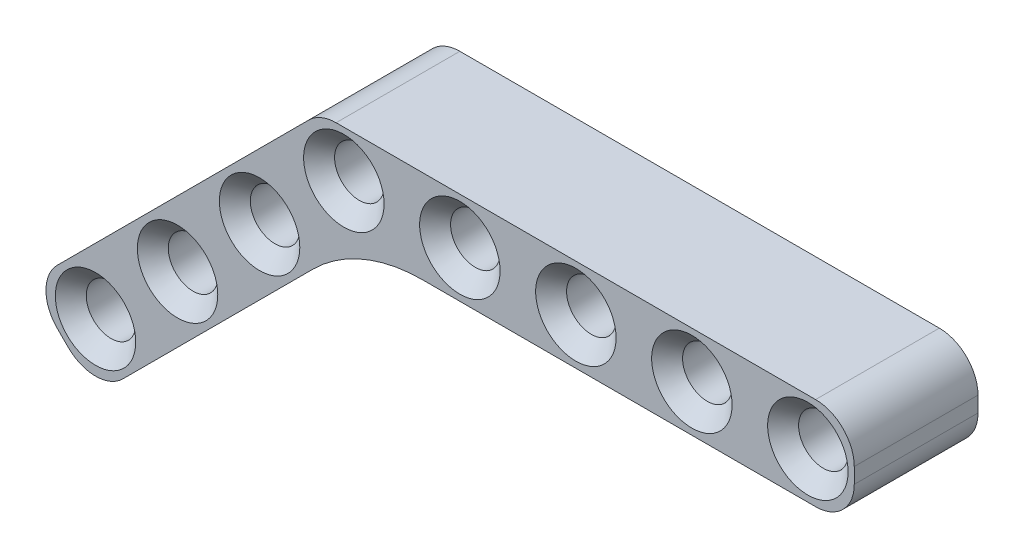
ISO-10303-21;
HEADER;
FILE_DESCRIPTION(('STEP AP214'),'2;1');
FILE_NAME('part.step','',(''),(''),'','','');
FILE_SCHEMA(('AUTOMOTIVE_DESIGN { 1 0 10303 214 1 1 1 1 }'));
ENDSEC;
DATA;
#1=APPLICATION_CONTEXT('core data for automotive mechanical design processes');
#2=APPLICATION_PROTOCOL_DEFINITION('international standard','automotive_design',2000,#1);
#3=PRODUCT_CONTEXT('',#1,'mechanical');
#4=PRODUCT('Part','Part','',(#3));
#5=PRODUCT_RELATED_PRODUCT_CATEGORY('part','',(#4));
#6=PRODUCT_DEFINITION_FORMATION('','',#4);
#7=PRODUCT_DEFINITION_CONTEXT('part definition',#1,'design');
#8=PRODUCT_DEFINITION('design','',#6,#7);
#9=PRODUCT_DEFINITION_SHAPE('','',#8);
#10=(LENGTH_UNIT() NAMED_UNIT(*) SI_UNIT(.MILLI.,.METRE.));
#11=(NAMED_UNIT(*) PLANE_ANGLE_UNIT() SI_UNIT($,.RADIAN.));
#12=(NAMED_UNIT(*) SI_UNIT($,.STERADIAN.) SOLID_ANGLE_UNIT());
#13=UNCERTAINTY_MEASURE_WITH_UNIT(LENGTH_MEASURE(1.E-05),#10,'distance_accuracy_value','');
#14=(GEOMETRIC_REPRESENTATION_CONTEXT(3) GLOBAL_UNCERTAINTY_ASSIGNED_CONTEXT((#13)) GLOBAL_UNIT_ASSIGNED_CONTEXT((#10,
#11,#12)) REPRESENTATION_CONTEXT('',''));
#15=CARTESIAN_POINT('',(0.,0.,0.));
#16=DIRECTION('',(0.,0.,1.));
#17=DIRECTION('',(1.,0.,0.));
#18=AXIS2_PLACEMENT_3D('',#15,#16,#17);
#19=CARTESIAN_POINT('',(-0.5,0.5,8.));
#20=DIRECTION('',(0.,0.,-1.));
#21=DIRECTION('',(-1.,0.,0.));
#22=AXIS2_PLACEMENT_3D('',#19,#20,#21);
#23=CYLINDRICAL_SURFACE('',#22,2.5);
#24=DIRECTION('',(0.,0.,1.));
#25=VECTOR('',#24,1.);
#26=CARTESIAN_POINT('',(-2.26776695296637,2.26776695296637,0.));
#27=LINE('',#26,#25);
#28=CARTESIAN_POINT('',(-2.26776695296637,2.26776695296637,0.));
#29=VERTEX_POINT('',#28);
#30=CARTESIAN_POINT('',(-2.26776695296637,2.26776695296637,8.));
#31=VERTEX_POINT('',#30);
#32=EDGE_CURVE('E172',#29,#31,#27,.T.);
#33=ORIENTED_EDGE('',*,*,#32,.T.);
#34=CARTESIAN_POINT('',(-0.5,0.5,8.));
#35=DIRECTION('',(0.,0.,1.));
#36=DIRECTION('',(1.,0.,0.));
#37=AXIS2_PLACEMENT_3D('',#34,#35,#36);
#38=CIRCLE('',#37,2.5);
#39=CARTESIAN_POINT('',(-0.5,3.,8.));
#40=VERTEX_POINT('',#39);
#41=EDGE_CURVE('E186',#40,#31,#38,.T.);
#42=ORIENTED_EDGE('',*,*,#41,.F.);
#43=DIRECTION('',(0.,0.,-1.));
#44=VECTOR('',#43,1.);
#45=CARTESIAN_POINT('',(-0.5,3.,8.));
#46=LINE('',#45,#44);
#47=CARTESIAN_POINT('',(-0.5,3.,0.));
#48=VERTEX_POINT('',#47);
#49=EDGE_CURVE('E206',#40,#48,#46,.T.);
#50=ORIENTED_EDGE('',*,*,#49,.T.);
#51=CARTESIAN_POINT('',(-0.5,0.5,0.));
#52=DIRECTION('',(0.,0.,1.));
#53=DIRECTION('',(1.,0.,0.));
#54=AXIS2_PLACEMENT_3D('',#51,#52,#53);
#55=CIRCLE('',#54,2.5);
#56=EDGE_CURVE('E200',#48,#29,#55,.T.);
#57=ORIENTED_EDGE('',*,*,#56,.T.);
#58=EDGE_LOOP('',(#33,#42,#50,#57));
#59=FACE_BOUND('',#58,.T.);
#60=ADVANCED_FACE('F35',(#59),#23,.T.);
#61=CARTESIAN_POINT('',(30.5,-0.5,8.));
#62=DIRECTION('',(0.,0.,1.));
#63=DIRECTION('',(1.,0.,0.));
#64=AXIS2_PLACEMENT_3D('',#61,#62,#63);
#65=PLANE('',#64);
#66=CARTESIAN_POINT('',(-16.0543267947628,-15.7614335759495,8.));
#67=DIRECTION('',(0.,0.,1.));
#68=DIRECTION('',(1.,0.,0.));
#69=AXIS2_PLACEMENT_3D('',#66,#67,#68);
#70=CIRCLE('',#69,2.59999999999999);
#71=CARTESIAN_POINT('',(-13.4543267947628,-15.7614335759495,8.));
#72=VERTEX_POINT('',#71);
#73=EDGE_CURVE('E297',#72,#72,#70,.F.);
#74=ORIENTED_EDGE('',*,*,#73,.T.);
#75=EDGE_LOOP('',(#74));
#76=FACE_BOUND('',#75,.T.);
#77=CARTESIAN_POINT('',(-10.7510259358637,-10.4581327170504,8.));
#78=DIRECTION('',(0.,0.,1.));
#79=DIRECTION('',(1.,0.,0.));
#80=AXIS2_PLACEMENT_3D('',#77,#78,#79);
#81=CIRCLE('',#80,2.59999999999999);
#82=CARTESIAN_POINT('',(-8.15102593586371,-10.4581327170504,8.));
#83=VERTEX_POINT('',#82);
#84=EDGE_CURVE('E294',#83,#83,#81,.F.);
#85=ORIENTED_EDGE('',*,*,#84,.T.);
#86=EDGE_LOOP('',(#85));
#87=FACE_BOUND('',#86,.T.);
#88=CARTESIAN_POINT('',(-5.44772507696464,-5.15483185815121,8.));
#89=DIRECTION('',(0.,0.,1.));
#90=DIRECTION('',(1.,0.,0.));
#91=AXIS2_PLACEMENT_3D('',#88,#89,#90);
#92=CIRCLE('',#91,2.6);
#93=CARTESIAN_POINT('',(-2.84772507696463,-5.15483185815121,8.));
#94=VERTEX_POINT('',#93);
#95=EDGE_CURVE('E291',#94,#94,#92,.F.);
#96=ORIENTED_EDGE('',*,*,#95,.T.);
#97=EDGE_LOOP('',(#96));
#98=FACE_BOUND('',#97,.T.);
#99=CARTESIAN_POINT('',(30.,0.,8.));
#100=DIRECTION('',(0.,0.,1.));
#101=DIRECTION('',(1.,0.,0.));
#102=AXIS2_PLACEMENT_3D('',#99,#100,#101);
#103=CIRCLE('',#102,2.6);
#104=CARTESIAN_POINT('',(32.6,0.,8.));
#105=VERTEX_POINT('',#104);
#106=EDGE_CURVE('E251',#105,#105,#103,.F.);
#107=ORIENTED_EDGE('',*,*,#106,.T.);
#108=EDGE_LOOP('',(#107));
#109=FACE_BOUND('',#108,.T.);
#110=CARTESIAN_POINT('',(22.5,0.,8.));
#111=DIRECTION('',(0.,0.,1.));
#112=DIRECTION('',(1.,0.,0.));
#113=AXIS2_PLACEMENT_3D('',#110,#111,#112);
#114=CIRCLE('',#113,2.6);
#115=CARTESIAN_POINT('',(25.1,0.,8.));
#116=VERTEX_POINT('',#115);
#117=EDGE_CURVE('E248',#116,#116,#114,.F.);
#118=ORIENTED_EDGE('',*,*,#117,.T.);
#119=EDGE_LOOP('',(#118));
#120=FACE_BOUND('',#119,.T.);
#121=CARTESIAN_POINT('',(15.,0.,8.));
#122=DIRECTION('',(0.,0.,1.));
#123=DIRECTION('',(1.,0.,0.));
#124=AXIS2_PLACEMENT_3D('',#121,#122,#123);
#125=CIRCLE('',#124,2.6);
#126=CARTESIAN_POINT('',(17.6,0.,8.));
#127=VERTEX_POINT('',#126);
#128=EDGE_CURVE('E245',#127,#127,#125,.F.);
#129=ORIENTED_EDGE('',*,*,#128,.T.);
#130=EDGE_LOOP('',(#129));
#131=FACE_BOUND('',#130,.T.);
#132=CARTESIAN_POINT('',(7.5,0.,8.));
#133=DIRECTION('',(0.,0.,1.));
#134=DIRECTION('',(1.,0.,0.));
#135=AXIS2_PLACEMENT_3D('',#132,#133,#134);
#136=CIRCLE('',#135,2.6);
#137=CARTESIAN_POINT('',(10.1,0.,8.));
#138=VERTEX_POINT('',#137);
#139=EDGE_CURVE('E242',#138,#138,#136,.F.);
#140=ORIENTED_EDGE('',*,*,#139,.T.);
#141=EDGE_LOOP('',(#140));
#142=FACE_BOUND('',#141,.T.);
#143=CARTESIAN_POINT('',(0.,0.,8.));
#144=DIRECTION('',(0.,0.,1.));
#145=DIRECTION('',(1.,0.,0.));
#146=AXIS2_PLACEMENT_3D('',#143,#144,#145);
#147=CIRCLE('',#146,2.6);
#148=CARTESIAN_POINT('',(2.6,0.,8.));
#149=VERTEX_POINT('',#148);
#150=EDGE_CURVE('E239',#149,#149,#147,.F.);
#151=ORIENTED_EDGE('',*,*,#150,.T.);
#152=EDGE_LOOP('',(#151));
#153=FACE_BOUND('',#152,.T.);
#154=CARTESIAN_POINT('',(30.5,-0.5,8.));
#155=DIRECTION('',(0.,0.,1.));
#156=DIRECTION('',(1.,0.,0.));
#157=AXIS2_PLACEMENT_3D('',#154,#155,#156);
#158=CIRCLE('',#157,2.5);
#159=CARTESIAN_POINT('',(30.5,-3.,8.));
#160=VERTEX_POINT('',#159);
#161=CARTESIAN_POINT('',(33.,-0.5,8.));
#162=VERTEX_POINT('',#161);
#163=EDGE_CURVE('E176',#160,#162,#158,.T.);
#164=ORIENTED_EDGE('',*,*,#163,.T.);
#165=DIRECTION('',(0.,1.,0.));
#166=VECTOR('',#165,1.);
#167=CARTESIAN_POINT('',(33.,0.5,8.));
#168=LINE('',#167,#166);
#169=CARTESIAN_POINT('',(33.,0.5,8.));
#170=VERTEX_POINT('',#169);
#171=EDGE_CURVE('E179',#162,#170,#168,.T.);
#172=ORIENTED_EDGE('',*,*,#171,.T.);
#173=CARTESIAN_POINT('',(30.5,0.5,8.));
#174=DIRECTION('',(0.,0.,1.));
#175=DIRECTION('',(-1.,0.,0.));
#176=AXIS2_PLACEMENT_3D('',#173,#174,#175);
#177=CIRCLE('',#176,2.5);
#178=CARTESIAN_POINT('',(30.5,3.,8.));
#179=VERTEX_POINT('',#178);
#180=EDGE_CURVE('E182',#170,#179,#177,.T.);
#181=ORIENTED_EDGE('',*,*,#180,.T.);
#182=DIRECTION('',(-1.,0.,0.));
#183=VECTOR('',#182,1.);
#184=CARTESIAN_POINT('',(-0.5,3.,8.));
#185=LINE('',#184,#183);
#186=EDGE_CURVE('E184',#179,#40,#185,.T.);
#187=ORIENTED_EDGE('',*,*,#186,.T.);
#188=ORIENTED_EDGE('',*,*,#41,.T.);
#189=DIRECTION('',(-0.707106781186546,-0.707106781186549,0.));
#190=VECTOR('',#189,1.);
#191=CARTESIAN_POINT('',(-2.26776695296637,2.26776695296636,8.));
#192=LINE('',#191,#190);
#193=CARTESIAN_POINT('',(-18.5292005289157,-13.9936666229831,8.));
#194=VERTEX_POINT('',#193);
#195=EDGE_CURVE('E153',#31,#194,#192,.T.);
#196=ORIENTED_EDGE('',*,*,#195,.T.);
#197=CARTESIAN_POINT('',(-16.7614335759494,-15.7614335759494,8.));
#198=DIRECTION('',(0.,0.,1.));
#199=DIRECTION('',(1.,0.,0.));
#200=AXIS2_PLACEMENT_3D('',#197,#198,#199);
#201=CIRCLE('',#200,2.5);
#202=CARTESIAN_POINT('',(-18.5292005289157,-17.5292005289158,8.));
#203=VERTEX_POINT('',#202);
#204=EDGE_CURVE('E150',#194,#203,#201,.T.);
#205=ORIENTED_EDGE('',*,*,#204,.T.);
#206=DIRECTION('',(0.707106781186546,-0.707106781186549,0.));
#207=VECTOR('',#206,1.);
#208=CARTESIAN_POINT('',(-18.0292005289158,-18.0292005289157,8.));
#209=LINE('',#208,#207);
#210=CARTESIAN_POINT('',(-17.8220937477292,-18.2363073101024,8.));
#211=VERTEX_POINT('',#210);
#212=EDGE_CURVE('E161',#203,#211,#209,.T.);
#213=ORIENTED_EDGE('',*,*,#212,.T.);
#214=CARTESIAN_POINT('',(-16.0543267947628,-16.468540357136,8.));
#215=DIRECTION('',(0.,0.,1.));
#216=DIRECTION('',(1.,0.,0.));
#217=AXIS2_PLACEMENT_3D('',#214,#215,#216);
#218=CIRCLE('',#217,2.5);
#219=CARTESIAN_POINT('',(-14.2865598417965,-18.2363073101024,8.));
#220=VERTEX_POINT('',#219);
#221=EDGE_CURVE('E129',#211,#220,#218,.T.);
#222=ORIENTED_EDGE('',*,*,#221,.T.);
#223=DIRECTION('',(0.707106781186546,0.707106781186549,0.));
#224=VECTOR('',#223,1.);
#225=CARTESIAN_POINT('',(1.97487373415292,-1.97487373415292,8.));
#226=LINE('',#225,#224);
#227=CARTESIAN_POINT('',(-1.97918471982868,-5.92893218813454,8.));
#228=VERTEX_POINT('',#227);
#229=EDGE_CURVE('E164',#220,#228,#226,.T.);
#230=ORIENTED_EDGE('',*,*,#229,.T.);
#231=CARTESIAN_POINT('',(5.09188309203681,-13.,8.));
#232=DIRECTION('',(0.,0.,1.));
#233=DIRECTION('',(1.,0.,0.));
#234=AXIS2_PLACEMENT_3D('',#231,#232,#233);
#235=CIRCLE('',#234,10.);
#236=CARTESIAN_POINT('',(5.09188309203681,-3.,8.));
#237=VERTEX_POINT('',#236);
#238=EDGE_CURVE('E58',#228,#237,#235,.F.);
#239=ORIENTED_EDGE('',*,*,#238,.T.);
#240=DIRECTION('',(1.,0.,0.));
#241=VECTOR('',#240,1.);
#242=CARTESIAN_POINT('',(-0.5,-3.,8.));
#243=LINE('',#242,#241);
#244=EDGE_CURVE('E189',#237,#160,#243,.T.);
#245=ORIENTED_EDGE('',*,*,#244,.T.);
#246=EDGE_LOOP('',(#164,#172,#181,#187,#188,#196,#205,#213,#222,#230,#239,#245));
#247=FACE_BOUND('',#246,.T.);
#248=ADVANCED_FACE('F327',(#76,#87,#98,#109,#120,#131,#142,#153,#247),#65,.T.);
#249=CARTESIAN_POINT('',(30.5,-0.5,0.));
#250=DIRECTION('',(0.,0.,1.));
#251=DIRECTION('',(1.,0.,0.));
#252=AXIS2_PLACEMENT_3D('',#249,#250,#251);
#253=PLANE('',#252);
#254=CARTESIAN_POINT('',(-16.0543267947628,-15.7614335759495,0.));
#255=DIRECTION('',(0.,0.,1.));
#256=DIRECTION('',(1.,0.,0.));
#257=AXIS2_PLACEMENT_3D('',#254,#255,#256);
#258=CIRCLE('',#257,2.6);
#259=CARTESIAN_POINT('',(-13.4543267947628,-15.7614335759495,0.));
#260=VERTEX_POINT('',#259);
#261=EDGE_CURVE('E306',#260,#260,#258,.T.);
#262=ORIENTED_EDGE('',*,*,#261,.T.);
#263=EDGE_LOOP('',(#262));
#264=FACE_BOUND('',#263,.T.);
#265=CARTESIAN_POINT('',(-10.7510259358637,-10.4581327170504,0.));
#266=DIRECTION('',(0.,0.,1.));
#267=DIRECTION('',(1.,0.,0.));
#268=AXIS2_PLACEMENT_3D('',#265,#266,#267);
#269=CIRCLE('',#268,2.6);
#270=CARTESIAN_POINT('',(-8.1510259358637,-10.4581327170504,0.));
#271=VERTEX_POINT('',#270);
#272=EDGE_CURVE('E303',#271,#271,#269,.T.);
#273=ORIENTED_EDGE('',*,*,#272,.T.);
#274=EDGE_LOOP('',(#273));
#275=FACE_BOUND('',#274,.T.);
#276=CARTESIAN_POINT('',(-5.44772507696464,-5.15483185815121,0.));
#277=DIRECTION('',(0.,0.,1.));
#278=DIRECTION('',(1.,0.,0.));
#279=AXIS2_PLACEMENT_3D('',#276,#277,#278);
#280=CIRCLE('',#279,2.6);
#281=CARTESIAN_POINT('',(-2.84772507696463,-5.15483185815121,0.));
#282=VERTEX_POINT('',#281);
#283=EDGE_CURVE('E300',#282,#282,#280,.T.);
#284=ORIENTED_EDGE('',*,*,#283,.T.);
#285=EDGE_LOOP('',(#284));
#286=FACE_BOUND('',#285,.T.);
#287=CARTESIAN_POINT('',(30.,0.,0.));
#288=DIRECTION('',(0.,0.,1.));
#289=DIRECTION('',(1.,0.,0.));
#290=AXIS2_PLACEMENT_3D('',#287,#288,#289);
#291=CIRCLE('',#290,2.6);
#292=CARTESIAN_POINT('',(32.6,0.,0.));
#293=VERTEX_POINT('',#292);
#294=EDGE_CURVE('E230',#293,#293,#291,.T.);
#295=ORIENTED_EDGE('',*,*,#294,.T.);
#296=EDGE_LOOP('',(#295));
#297=FACE_BOUND('',#296,.T.);
#298=CARTESIAN_POINT('',(22.5,0.,0.));
#299=DIRECTION('',(0.,0.,1.));
#300=DIRECTION('',(1.,0.,0.));
#301=AXIS2_PLACEMENT_3D('',#298,#299,#300);
#302=CIRCLE('',#301,2.59999999999999);
#303=CARTESIAN_POINT('',(25.1,0.,0.));
#304=VERTEX_POINT('',#303);
#305=EDGE_CURVE('E227',#304,#304,#302,.T.);
#306=ORIENTED_EDGE('',*,*,#305,.T.);
#307=EDGE_LOOP('',(#306));
#308=FACE_BOUND('',#307,.T.);
#309=CARTESIAN_POINT('',(15.,0.,0.));
#310=DIRECTION('',(0.,0.,1.));
#311=DIRECTION('',(1.,0.,0.));
#312=AXIS2_PLACEMENT_3D('',#309,#310,#311);
#313=CIRCLE('',#312,2.59999999999999);
#314=CARTESIAN_POINT('',(17.6,0.,0.));
#315=VERTEX_POINT('',#314);
#316=EDGE_CURVE('E224',#315,#315,#313,.T.);
#317=ORIENTED_EDGE('',*,*,#316,.T.);
#318=EDGE_LOOP('',(#317));
#319=FACE_BOUND('',#318,.T.);
#320=CARTESIAN_POINT('',(7.5,0.,0.));
#321=DIRECTION('',(0.,0.,1.));
#322=DIRECTION('',(1.,0.,0.));
#323=AXIS2_PLACEMENT_3D('',#320,#321,#322);
#324=CIRCLE('',#323,2.6);
#325=CARTESIAN_POINT('',(10.1,0.,0.));
#326=VERTEX_POINT('',#325);
#327=EDGE_CURVE('E221',#326,#326,#324,.T.);
#328=ORIENTED_EDGE('',*,*,#327,.T.);
#329=EDGE_LOOP('',(#328));
#330=FACE_BOUND('',#329,.T.);
#331=CARTESIAN_POINT('',(0.,0.,0.));
#332=DIRECTION('',(0.,0.,1.));
#333=DIRECTION('',(1.,0.,0.));
#334=AXIS2_PLACEMENT_3D('',#331,#332,#333);
#335=CIRCLE('',#334,2.6);
#336=CARTESIAN_POINT('',(2.6,0.,0.));
#337=VERTEX_POINT('',#336);
#338=EDGE_CURVE('E218',#337,#337,#335,.T.);
#339=ORIENTED_EDGE('',*,*,#338,.T.);
#340=EDGE_LOOP('',(#339));
#341=FACE_BOUND('',#340,.T.);
#342=CARTESIAN_POINT('',(30.5,-0.5,0.));
#343=DIRECTION('',(0.,0.,1.));
#344=DIRECTION('',(1.,0.,0.));
#345=AXIS2_PLACEMENT_3D('',#342,#343,#344);
#346=CIRCLE('',#345,2.5);
#347=CARTESIAN_POINT('',(30.5,-3.,0.));
#348=VERTEX_POINT('',#347);
#349=CARTESIAN_POINT('',(33.,-0.5,0.));
#350=VERTEX_POINT('',#349);
#351=EDGE_CURVE('E169',#348,#350,#346,.T.);
#352=ORIENTED_EDGE('',*,*,#351,.F.);
#353=DIRECTION('',(1.,0.,0.));
#354=VECTOR('',#353,1.);
#355=CARTESIAN_POINT('',(-0.5,-3.,0.));
#356=LINE('',#355,#354);
#357=CARTESIAN_POINT('',(5.09188309203681,-3.,0.));
#358=VERTEX_POINT('',#357);
#359=EDGE_CURVE('E180',#358,#348,#356,.T.);
#360=ORIENTED_EDGE('',*,*,#359,.F.);
#361=CARTESIAN_POINT('',(5.09188309203681,-13.,0.));
#362=DIRECTION('',(0.,0.,1.));
#363=DIRECTION('',(1.,0.,0.));
#364=AXIS2_PLACEMENT_3D('',#361,#362,#363);
#365=CIRCLE('',#364,10.);
#366=CARTESIAN_POINT('',(-1.97918471982868,-5.92893218813454,0.));
#367=VERTEX_POINT('',#366);
#368=EDGE_CURVE('E283',#358,#367,#365,.T.);
#369=ORIENTED_EDGE('',*,*,#368,.T.);
#370=DIRECTION('',(0.707106781186546,0.707106781186549,0.));
#371=VECTOR('',#370,1.);
#372=CARTESIAN_POINT('',(1.97487373415292,-1.97487373415292,0.));
#373=LINE('',#372,#371);
#374=CARTESIAN_POINT('',(-14.2865598417965,-18.2363073101024,0.));
#375=VERTEX_POINT('',#374);
#376=EDGE_CURVE('E146',#375,#367,#373,.T.);
#377=ORIENTED_EDGE('',*,*,#376,.F.);
#378=CARTESIAN_POINT('',(-16.0543267947628,-16.468540357136,0.));
#379=DIRECTION('',(0.,0.,1.));
#380=DIRECTION('',(1.,0.,0.));
#381=AXIS2_PLACEMENT_3D('',#378,#379,#380);
#382=CIRCLE('',#381,2.5);
#383=CARTESIAN_POINT('',(-17.8220937477292,-18.2363073101024,0.));
#384=VERTEX_POINT('',#383);
#385=EDGE_CURVE('E127',#384,#375,#382,.T.);
#386=ORIENTED_EDGE('',*,*,#385,.F.);
#387=DIRECTION('',(0.707106781186546,-0.707106781186549,0.));
#388=VECTOR('',#387,1.);
#389=CARTESIAN_POINT('',(-18.0292005289158,-18.0292005289157,0.));
#390=LINE('',#389,#388);
#391=CARTESIAN_POINT('',(-18.5292005289157,-17.5292005289158,0.));
#392=VERTEX_POINT('',#391);
#393=EDGE_CURVE('E143',#392,#384,#390,.T.);
#394=ORIENTED_EDGE('',*,*,#393,.F.);
#395=CARTESIAN_POINT('',(-16.7614335759494,-15.7614335759494,0.));
#396=DIRECTION('',(0.,0.,1.));
#397=DIRECTION('',(1.,0.,0.));
#398=AXIS2_PLACEMENT_3D('',#395,#396,#397);
#399=CIRCLE('',#398,2.5);
#400=CARTESIAN_POINT('',(-18.5292005289157,-13.9936666229831,0.));
#401=VERTEX_POINT('',#400);
#402=EDGE_CURVE('E135',#401,#392,#399,.T.);
#403=ORIENTED_EDGE('',*,*,#402,.F.);
#404=DIRECTION('',(-0.707106781186546,-0.707106781186549,0.));
#405=VECTOR('',#404,1.);
#406=CARTESIAN_POINT('',(-2.26776695296637,2.26776695296636,0.));
#407=LINE('',#406,#405);
#408=EDGE_CURVE('E157',#29,#401,#407,.T.);
#409=ORIENTED_EDGE('',*,*,#408,.F.);
#410=ORIENTED_EDGE('',*,*,#56,.F.);
#411=DIRECTION('',(-1.,0.,0.));
#412=VECTOR('',#411,1.);
#413=CARTESIAN_POINT('',(-0.5,3.,0.));
#414=LINE('',#413,#412);
#415=CARTESIAN_POINT('',(30.5,3.,0.));
#416=VERTEX_POINT('',#415);
#417=EDGE_CURVE('E198',#416,#48,#414,.T.);
#418=ORIENTED_EDGE('',*,*,#417,.F.);
#419=CARTESIAN_POINT('',(30.5,0.5,0.));
#420=DIRECTION('',(0.,0.,1.));
#421=DIRECTION('',(-1.,0.,0.));
#422=AXIS2_PLACEMENT_3D('',#419,#420,#421);
#423=CIRCLE('',#422,2.5);
#424=CARTESIAN_POINT('',(33.,0.5,0.));
#425=VERTEX_POINT('',#424);
#426=EDGE_CURVE('E196',#425,#416,#423,.T.);
#427=ORIENTED_EDGE('',*,*,#426,.F.);
#428=DIRECTION('',(0.,1.,0.));
#429=VECTOR('',#428,1.);
#430=CARTESIAN_POINT('',(33.,0.5,0.));
#431=LINE('',#430,#429);
#432=EDGE_CURVE('E194',#350,#425,#431,.T.);
#433=ORIENTED_EDGE('',*,*,#432,.F.);
#434=EDGE_LOOP('',(#352,#360,#369,#377,#386,#394,#403,#409,#410,#418,#427,#433));
#435=FACE_BOUND('',#434,.T.);
#436=ADVANCED_FACE('F141',(#264,#275,#286,#297,#308,#319,#330,#341,#435),#253,.F.);
#437=CARTESIAN_POINT('',(30.5,-0.5,8.));
#438=DIRECTION('',(0.,0.,-1.));
#439=DIRECTION('',(-1.,0.,0.));
#440=AXIS2_PLACEMENT_3D('',#437,#438,#439);
#441=CYLINDRICAL_SURFACE('',#440,2.5);
#442=ORIENTED_EDGE('',*,*,#351,.T.);
#443=DIRECTION('',(0.,0.,-1.));
#444=VECTOR('',#443,1.);
#445=CARTESIAN_POINT('',(33.,-0.5,8.));
#446=LINE('',#445,#444);
#447=EDGE_CURVE('E215',#162,#350,#446,.T.);
#448=ORIENTED_EDGE('',*,*,#447,.F.);
#449=ORIENTED_EDGE('',*,*,#163,.F.);
#450=DIRECTION('',(0.,0.,-1.));
#451=VECTOR('',#450,1.);
#452=CARTESIAN_POINT('',(30.5,-3.,8.));
#453=LINE('',#452,#451);
#454=EDGE_CURVE('E191',#160,#348,#453,.T.);
#455=ORIENTED_EDGE('',*,*,#454,.T.);
#456=EDGE_LOOP('',(#442,#448,#449,#455));
#457=FACE_BOUND('',#456,.T.);
#458=ADVANCED_FACE('F326',(#457),#441,.T.);
#459=CARTESIAN_POINT('',(33.,0.5,8.));
#460=DIRECTION('',(-1.,0.,0.));
#461=DIRECTION('',(0.,0.,1.));
#462=AXIS2_PLACEMENT_3D('',#459,#460,#461);
#463=PLANE('',#462);
#464=ORIENTED_EDGE('',*,*,#432,.T.);
#465=DIRECTION('',(0.,0.,-1.));
#466=VECTOR('',#465,1.);
#467=CARTESIAN_POINT('',(33.,0.5,8.));
#468=LINE('',#467,#466);
#469=EDGE_CURVE('E212',#170,#425,#468,.T.);
#470=ORIENTED_EDGE('',*,*,#469,.F.);
#471=ORIENTED_EDGE('',*,*,#171,.F.);
#472=ORIENTED_EDGE('',*,*,#447,.T.);
#473=EDGE_LOOP('',(#464,#470,#471,#472));
#474=FACE_BOUND('',#473,.T.);
#475=ADVANCED_FACE('F374',(#474),#463,.F.);
#476=CARTESIAN_POINT('',(30.5,0.5,8.));
#477=DIRECTION('',(0.,0.,-1.));
#478=DIRECTION('',(-1.,0.,0.));
#479=AXIS2_PLACEMENT_3D('',#476,#477,#478);
#480=CYLINDRICAL_SURFACE('',#479,2.5);
#481=ORIENTED_EDGE('',*,*,#426,.T.);
#482=DIRECTION('',(0.,0.,-1.));
#483=VECTOR('',#482,1.);
#484=CARTESIAN_POINT('',(30.5,3.,8.));
#485=LINE('',#484,#483);
#486=EDGE_CURVE('E209',#179,#416,#485,.T.);
#487=ORIENTED_EDGE('',*,*,#486,.F.);
#488=ORIENTED_EDGE('',*,*,#180,.F.);
#489=ORIENTED_EDGE('',*,*,#469,.T.);
#490=EDGE_LOOP('',(#481,#487,#488,#489));
#491=FACE_BOUND('',#490,.T.);
#492=ADVANCED_FACE('F370',(#491),#480,.T.);
#493=CARTESIAN_POINT('',(-0.5,3.,8.));
#494=DIRECTION('',(0.,-1.,0.));
#495=DIRECTION('',(1.,0.,0.));
#496=AXIS2_PLACEMENT_3D('',#493,#494,#495);
#497=PLANE('',#496);
#498=ORIENTED_EDGE('',*,*,#417,.T.);
#499=ORIENTED_EDGE('',*,*,#49,.F.);
#500=ORIENTED_EDGE('',*,*,#186,.F.);
#501=ORIENTED_EDGE('',*,*,#486,.T.);
#502=EDGE_LOOP('',(#498,#499,#500,#501));
#503=FACE_BOUND('',#502,.T.);
#504=ADVANCED_FACE('F367',(#503),#497,.F.);
#505=CARTESIAN_POINT('',(-0.5,-3.,8.));
#506=DIRECTION('',(0.,1.,0.));
#507=DIRECTION('',(-1.,0.,0.));
#508=AXIS2_PLACEMENT_3D('',#505,#506,#507);
#509=PLANE('',#508);
#510=ORIENTED_EDGE('',*,*,#244,.F.);
#511=DIRECTION('',(0.,0.,1.));
#512=VECTOR('',#511,1.);
#513=CARTESIAN_POINT('',(5.09188309203681,-3.,8.));
#514=LINE('',#513,#512);
#515=EDGE_CURVE('E50',#237,#358,#514,.F.);
#516=ORIENTED_EDGE('',*,*,#515,.T.);
#517=ORIENTED_EDGE('',*,*,#359,.T.);
#518=ORIENTED_EDGE('',*,*,#454,.F.);
#519=EDGE_LOOP('',(#510,#516,#517,#518));
#520=FACE_BOUND('',#519,.T.);
#521=ADVANCED_FACE('F366',(#520),#509,.F.);
#522=CARTESIAN_POINT('',(0.,0.,8.));
#523=DIRECTION('',(0.,0.,-1.));
#524=DIRECTION('',(-1.,0.,0.));
#525=AXIS2_PLACEMENT_3D('',#522,#523,#524);
#526=CYLINDRICAL_SURFACE('',#525,1.6);
#527=CARTESIAN_POINT('',(0.,0.,1.00000000000001));
#528=DIRECTION('',(0.,0.,1.));
#529=DIRECTION('',(1.,0.,0.));
#530=AXIS2_PLACEMENT_3D('',#527,#528,#529);
#531=CIRCLE('',#530,1.6);
#532=CARTESIAN_POINT('',(1.6,0.,1.00000000000001));
#533=VERTEX_POINT('',#532);
#534=EDGE_CURVE('E275',#533,#533,#531,.F.);
#535=ORIENTED_EDGE('',*,*,#534,.T.);
#536=EDGE_LOOP('',(#535));
#537=FACE_BOUND('',#536,.T.);
#538=CARTESIAN_POINT('',(0.,0.,7.));
#539=DIRECTION('',(0.,0.,1.));
#540=DIRECTION('',(1.,0.,0.));
#541=AXIS2_PLACEMENT_3D('',#538,#539,#540);
#542=CIRCLE('',#541,1.6);
#543=CARTESIAN_POINT('',(1.6,0.,7.));
#544=VERTEX_POINT('',#543);
#545=EDGE_CURVE('E272',#544,#544,#542,.T.);
#546=ORIENTED_EDGE('',*,*,#545,.T.);
#547=EDGE_LOOP('',(#546));
#548=FACE_BOUND('',#547,.T.);
#549=ADVANCED_FACE('F418',(#537,#548),#526,.F.);
#550=CARTESIAN_POINT('',(7.5,0.,8.));
#551=DIRECTION('',(0.,0.,-1.));
#552=DIRECTION('',(-1.,0.,0.));
#553=AXIS2_PLACEMENT_3D('',#550,#551,#552);
#554=CYLINDRICAL_SURFACE('',#553,1.6);
#555=CARTESIAN_POINT('',(7.5,0.,1.));
#556=DIRECTION('',(0.,0.,1.));
#557=DIRECTION('',(1.,0.,0.));
#558=AXIS2_PLACEMENT_3D('',#555,#556,#557);
#559=CIRCLE('',#558,1.6);
#560=CARTESIAN_POINT('',(9.1,0.,1.));
#561=VERTEX_POINT('',#560);
#562=EDGE_CURVE('E269',#561,#561,#559,.F.);
#563=ORIENTED_EDGE('',*,*,#562,.T.);
#564=EDGE_LOOP('',(#563));
#565=FACE_BOUND('',#564,.T.);
#566=CARTESIAN_POINT('',(7.5,0.,7.00000000000001));
#567=DIRECTION('',(0.,0.,1.));
#568=DIRECTION('',(1.,0.,0.));
#569=AXIS2_PLACEMENT_3D('',#566,#567,#568);
#570=CIRCLE('',#569,1.6);
#571=CARTESIAN_POINT('',(9.1,0.,7.00000000000001));
#572=VERTEX_POINT('',#571);
#573=EDGE_CURVE('E266',#572,#572,#570,.T.);
#574=ORIENTED_EDGE('',*,*,#573,.T.);
#575=EDGE_LOOP('',(#574));
#576=FACE_BOUND('',#575,.T.);
#577=ADVANCED_FACE('F414',(#565,#576),#554,.F.);
#578=CARTESIAN_POINT('',(15.,0.,8.));
#579=DIRECTION('',(0.,0.,-1.));
#580=DIRECTION('',(-1.,0.,0.));
#581=AXIS2_PLACEMENT_3D('',#578,#579,#580);
#582=CYLINDRICAL_SURFACE('',#581,1.6);
#583=CARTESIAN_POINT('',(15.,0.,0.999999999999997));
#584=DIRECTION('',(0.,0.,1.));
#585=DIRECTION('',(1.,0.,0.));
#586=AXIS2_PLACEMENT_3D('',#583,#584,#585);
#587=CIRCLE('',#586,1.6);
#588=CARTESIAN_POINT('',(16.6,0.,0.999999999999997));
#589=VERTEX_POINT('',#588);
#590=EDGE_CURVE('E263',#589,#589,#587,.F.);
#591=ORIENTED_EDGE('',*,*,#590,.T.);
#592=EDGE_LOOP('',(#591));
#593=FACE_BOUND('',#592,.T.);
#594=CARTESIAN_POINT('',(15.,0.,7.));
#595=DIRECTION('',(0.,0.,1.));
#596=DIRECTION('',(1.,0.,0.));
#597=AXIS2_PLACEMENT_3D('',#594,#595,#596);
#598=CIRCLE('',#597,1.6);
#599=CARTESIAN_POINT('',(16.6,0.,7.));
#600=VERTEX_POINT('',#599);
#601=EDGE_CURVE('E260',#600,#600,#598,.T.);
#602=ORIENTED_EDGE('',*,*,#601,.T.);
#603=EDGE_LOOP('',(#602));
#604=FACE_BOUND('',#603,.T.);
#605=ADVANCED_FACE('F417',(#593,#604),#582,.F.);
#606=CARTESIAN_POINT('',(22.5,0.,8.));
#607=DIRECTION('',(0.,0.,-1.));
#608=DIRECTION('',(-1.,0.,0.));
#609=AXIS2_PLACEMENT_3D('',#606,#607,#608);
#610=CYLINDRICAL_SURFACE('',#609,1.6);
#611=CARTESIAN_POINT('',(22.5,0.,0.999999999999997));
#612=DIRECTION('',(0.,0.,1.));
#613=DIRECTION('',(1.,0.,0.));
#614=AXIS2_PLACEMENT_3D('',#611,#612,#613);
#615=CIRCLE('',#614,1.6);
#616=CARTESIAN_POINT('',(24.1,0.,0.999999999999997));
#617=VERTEX_POINT('',#616);
#618=EDGE_CURVE('E257',#617,#617,#615,.F.);
#619=ORIENTED_EDGE('',*,*,#618,.T.);
#620=EDGE_LOOP('',(#619));
#621=FACE_BOUND('',#620,.T.);
#622=CARTESIAN_POINT('',(22.5,0.,7.));
#623=DIRECTION('',(0.,0.,1.));
#624=DIRECTION('',(1.,0.,0.));
#625=AXIS2_PLACEMENT_3D('',#622,#623,#624);
#626=CIRCLE('',#625,1.6);
#627=CARTESIAN_POINT('',(24.1,0.,7.));
#628=VERTEX_POINT('',#627);
#629=EDGE_CURVE('E254',#628,#628,#626,.T.);
#630=ORIENTED_EDGE('',*,*,#629,.T.);
#631=EDGE_LOOP('',(#630));
#632=FACE_BOUND('',#631,.T.);
#633=ADVANCED_FACE('F426',(#621,#632),#610,.F.);
#634=CARTESIAN_POINT('',(30.,0.,8.));
#635=DIRECTION('',(0.,0.,-1.));
#636=DIRECTION('',(-1.,0.,0.));
#637=AXIS2_PLACEMENT_3D('',#634,#635,#636);
#638=CYLINDRICAL_SURFACE('',#637,1.6);
#639=CARTESIAN_POINT('',(30.,0.,0.999999999999997));
#640=DIRECTION('',(0.,0.,1.));
#641=DIRECTION('',(1.,0.,0.));
#642=AXIS2_PLACEMENT_3D('',#639,#640,#641);
#643=CIRCLE('',#642,1.6);
#644=CARTESIAN_POINT('',(31.6,0.,0.999999999999997));
#645=VERTEX_POINT('',#644);
#646=EDGE_CURVE('E236',#645,#645,#643,.F.);
#647=ORIENTED_EDGE('',*,*,#646,.T.);
#648=EDGE_LOOP('',(#647));
#649=FACE_BOUND('',#648,.T.);
#650=CARTESIAN_POINT('',(30.,0.,7.));
#651=DIRECTION('',(0.,0.,1.));
#652=DIRECTION('',(1.,0.,0.));
#653=AXIS2_PLACEMENT_3D('',#650,#651,#652);
#654=CIRCLE('',#653,1.6);
#655=CARTESIAN_POINT('',(31.6,0.,7.));
#656=VERTEX_POINT('',#655);
#657=EDGE_CURVE('E233',#656,#656,#654,.T.);
#658=ORIENTED_EDGE('',*,*,#657,.T.);
#659=EDGE_LOOP('',(#658));
#660=FACE_BOUND('',#659,.T.);
#661=ADVANCED_FACE('F386',(#649,#660),#638,.F.);
#662=CARTESIAN_POINT('',(30.,0.,0.));
#663=DIRECTION('',(0.,0.,-1.));
#664=DIRECTION('',(-1.,0.,0.));
#665=AXIS2_PLACEMENT_3D('',#662,#663,#664);
#666=CONICAL_SURFACE('',#665,2.59999999999999,0.785398163397448);
#667=ORIENTED_EDGE('',*,*,#646,.F.);
#668=EDGE_LOOP('',(#667));
#669=FACE_BOUND('',#668,.T.);
#670=ORIENTED_EDGE('',*,*,#294,.F.);
#671=EDGE_LOOP('',(#670));
#672=FACE_BOUND('',#671,.T.);
#673=ADVANCED_FACE('F382',(#669,#672),#666,.F.);
#674=CARTESIAN_POINT('',(30.,0.,7.));
#675=DIRECTION('',(0.,0.,1.));
#676=DIRECTION('',(1.,0.,0.));
#677=AXIS2_PLACEMENT_3D('',#674,#675,#676);
#678=CONICAL_SURFACE('',#677,1.6,0.78539816339745);
#679=ORIENTED_EDGE('',*,*,#106,.F.);
#680=EDGE_LOOP('',(#679));
#681=FACE_BOUND('',#680,.T.);
#682=ORIENTED_EDGE('',*,*,#657,.F.);
#683=EDGE_LOOP('',(#682));
#684=FACE_BOUND('',#683,.T.);
#685=ADVANCED_FACE('F385',(#681,#684),#678,.F.);
#686=CARTESIAN_POINT('',(22.5,0.,0.));
#687=DIRECTION('',(0.,0.,-1.));
#688=DIRECTION('',(-1.,0.,0.));
#689=AXIS2_PLACEMENT_3D('',#686,#687,#688);
#690=CONICAL_SURFACE('',#689,2.59999999999999,0.785398163397448);
#691=ORIENTED_EDGE('',*,*,#618,.F.);
#692=EDGE_LOOP('',(#691));
#693=FACE_BOUND('',#692,.T.);
#694=ORIENTED_EDGE('',*,*,#305,.F.);
#695=EDGE_LOOP('',(#694));
#696=FACE_BOUND('',#695,.T.);
#697=ADVANCED_FACE('F390',(#693,#696),#690,.F.);
#698=CARTESIAN_POINT('',(22.5,0.,7.));
#699=DIRECTION('',(0.,0.,1.));
#700=DIRECTION('',(1.,0.,0.));
#701=AXIS2_PLACEMENT_3D('',#698,#699,#700);
#702=CONICAL_SURFACE('',#701,1.6,0.78539816339745);
#703=ORIENTED_EDGE('',*,*,#117,.F.);
#704=EDGE_LOOP('',(#703));
#705=FACE_BOUND('',#704,.T.);
#706=ORIENTED_EDGE('',*,*,#629,.F.);
#707=EDGE_LOOP('',(#706));
#708=FACE_BOUND('',#707,.T.);
#709=ADVANCED_FACE('F394',(#705,#708),#702,.F.);
#710=CARTESIAN_POINT('',(15.,0.,0.));
#711=DIRECTION('',(0.,0.,-1.));
#712=DIRECTION('',(-1.,0.,0.));
#713=AXIS2_PLACEMENT_3D('',#710,#711,#712);
#714=CONICAL_SURFACE('',#713,2.59999999999999,0.785398163397448);
#715=ORIENTED_EDGE('',*,*,#590,.F.);
#716=EDGE_LOOP('',(#715));
#717=FACE_BOUND('',#716,.T.);
#718=ORIENTED_EDGE('',*,*,#316,.F.);
#719=EDGE_LOOP('',(#718));
#720=FACE_BOUND('',#719,.T.);
#721=ADVANCED_FACE('F398',(#717,#720),#714,.F.);
#722=CARTESIAN_POINT('',(15.,0.,7.));
#723=DIRECTION('',(0.,0.,1.));
#724=DIRECTION('',(1.,0.,0.));
#725=AXIS2_PLACEMENT_3D('',#722,#723,#724);
#726=CONICAL_SURFACE('',#725,1.6,0.78539816339745);
#727=ORIENTED_EDGE('',*,*,#128,.F.);
#728=EDGE_LOOP('',(#727));
#729=FACE_BOUND('',#728,.T.);
#730=ORIENTED_EDGE('',*,*,#601,.F.);
#731=EDGE_LOOP('',(#730));
#732=FACE_BOUND('',#731,.T.);
#733=ADVANCED_FACE('F402',(#729,#732),#726,.F.);
#734=CARTESIAN_POINT('',(7.5,0.,0.));
#735=DIRECTION('',(0.,0.,-1.));
#736=DIRECTION('',(-1.,0.,0.));
#737=AXIS2_PLACEMENT_3D('',#734,#735,#736);
#738=CONICAL_SURFACE('',#737,2.6,0.785398163397448);
#739=ORIENTED_EDGE('',*,*,#562,.F.);
#740=EDGE_LOOP('',(#739));
#741=FACE_BOUND('',#740,.T.);
#742=ORIENTED_EDGE('',*,*,#327,.F.);
#743=EDGE_LOOP('',(#742));
#744=FACE_BOUND('',#743,.T.);
#745=ADVANCED_FACE('F352',(#741,#744),#738,.F.);
#746=CARTESIAN_POINT('',(7.5,0.,7.00000000000001));
#747=DIRECTION('',(0.,0.,1.));
#748=DIRECTION('',(1.,0.,0.));
#749=AXIS2_PLACEMENT_3D('',#746,#747,#748);
#750=CONICAL_SURFACE('',#749,1.6,0.785398163397449);
#751=ORIENTED_EDGE('',*,*,#139,.F.);
#752=EDGE_LOOP('',(#751));
#753=FACE_BOUND('',#752,.T.);
#754=ORIENTED_EDGE('',*,*,#573,.F.);
#755=EDGE_LOOP('',(#754));
#756=FACE_BOUND('',#755,.T.);
#757=ADVANCED_FACE('F343',(#753,#756),#750,.F.);
#758=CARTESIAN_POINT('',(0.,0.,0.));
#759=DIRECTION('',(0.,0.,-1.));
#760=DIRECTION('',(-1.,0.,0.));
#761=AXIS2_PLACEMENT_3D('',#758,#759,#760);
#762=CONICAL_SURFACE('',#761,2.6,0.785398163397448);
#763=ORIENTED_EDGE('',*,*,#534,.F.);
#764=EDGE_LOOP('',(#763));
#765=FACE_BOUND('',#764,.T.);
#766=ORIENTED_EDGE('',*,*,#338,.F.);
#767=EDGE_LOOP('',(#766));
#768=FACE_BOUND('',#767,.T.);
#769=ADVANCED_FACE('F340',(#765,#768),#762,.F.);
#770=CARTESIAN_POINT('',(0.,0.,7.));
#771=DIRECTION('',(0.,0.,1.));
#772=DIRECTION('',(1.,0.,0.));
#773=AXIS2_PLACEMENT_3D('',#770,#771,#772);
#774=CONICAL_SURFACE('',#773,1.6,0.785398163397449);
#775=ORIENTED_EDGE('',*,*,#150,.F.);
#776=EDGE_LOOP('',(#775));
#777=FACE_BOUND('',#776,.T.);
#778=ORIENTED_EDGE('',*,*,#545,.F.);
#779=EDGE_LOOP('',(#778));
#780=FACE_BOUND('',#779,.T.);
#781=ADVANCED_FACE('F342',(#777,#780),#774,.F.);
#782=CARTESIAN_POINT('',(-18.0292005289158,-18.0292005289157,0.));
#783=DIRECTION('',(-0.707106781186549,-0.707106781186546,0.));
#784=DIRECTION('',(0.707106781186546,-0.707106781186549,0.));
#785=AXIS2_PLACEMENT_3D('',#782,#783,#784);
#786=PLANE('',#785);
#787=ORIENTED_EDGE('',*,*,#212,.F.);
#788=DIRECTION('',(0.,0.,1.));
#789=VECTOR('',#788,1.);
#790=CARTESIAN_POINT('',(-18.5292005289157,-17.5292005289158,0.));
#791=LINE('',#790,#789);
#792=EDGE_CURVE('E149',#392,#203,#791,.T.);
#793=ORIENTED_EDGE('',*,*,#792,.F.);
#794=ORIENTED_EDGE('',*,*,#393,.T.);
#795=DIRECTION('',(0.,0.,1.));
#796=VECTOR('',#795,1.);
#797=CARTESIAN_POINT('',(-17.8220937477292,-18.2363073101024,0.));
#798=LINE('',#797,#796);
#799=EDGE_CURVE('E124',#384,#211,#798,.T.);
#800=ORIENTED_EDGE('',*,*,#799,.T.);
#801=EDGE_LOOP('',(#787,#793,#794,#800));
#802=FACE_BOUND('',#801,.T.);
#803=ADVANCED_FACE('F148',(#802),#786,.T.);
#804=CARTESIAN_POINT('',(-16.7614335759494,-15.7614335759494,0.));
#805=DIRECTION('',(0.,0.,1.));
#806=DIRECTION('',(1.,0.,0.));
#807=AXIS2_PLACEMENT_3D('',#804,#805,#806);
#808=CYLINDRICAL_SURFACE('',#807,2.5);
#809=ORIENTED_EDGE('',*,*,#204,.F.);
#810=DIRECTION('',(0.,0.,1.));
#811=VECTOR('',#810,1.);
#812=CARTESIAN_POINT('',(-18.5292005289157,-13.9936666229831,0.));
#813=LINE('',#812,#811);
#814=EDGE_CURVE('E170',#401,#194,#813,.T.);
#815=ORIENTED_EDGE('',*,*,#814,.F.);
#816=ORIENTED_EDGE('',*,*,#402,.T.);
#817=ORIENTED_EDGE('',*,*,#792,.T.);
#818=EDGE_LOOP('',(#809,#815,#816,#817));
#819=FACE_BOUND('',#818,.T.);
#820=ADVANCED_FACE('F452',(#819),#808,.T.);
#821=CARTESIAN_POINT('',(-2.26776695296637,2.26776695296636,0.));
#822=DIRECTION('',(-0.707106781186549,0.707106781186546,0.));
#823=DIRECTION('',(-0.707106781186546,-0.707106781186549,0.));
#824=AXIS2_PLACEMENT_3D('',#821,#822,#823);
#825=PLANE('',#824);
#826=ORIENTED_EDGE('',*,*,#195,.F.);
#827=ORIENTED_EDGE('',*,*,#32,.F.);
#828=ORIENTED_EDGE('',*,*,#408,.T.);
#829=ORIENTED_EDGE('',*,*,#814,.T.);
#830=EDGE_LOOP('',(#826,#827,#828,#829));
#831=FACE_BOUND('',#830,.T.);
#832=ADVANCED_FACE('F458',(#831),#825,.T.);
#833=CARTESIAN_POINT('',(1.97487373415292,-1.97487373415292,0.));
#834=DIRECTION('',(0.707106781186549,-0.707106781186546,0.));
#835=DIRECTION('',(0.707106781186546,0.707106781186549,0.));
#836=AXIS2_PLACEMENT_3D('',#833,#834,#835);
#837=PLANE('',#836);
#838=ORIENTED_EDGE('',*,*,#376,.T.);
#839=DIRECTION('',(0.,0.,1.));
#840=VECTOR('',#839,1.);
#841=CARTESIAN_POINT('',(-1.97918471982868,-5.92893218813454,0.));
#842=LINE('',#841,#840);
#843=EDGE_CURVE('E278',#367,#228,#842,.T.);
#844=ORIENTED_EDGE('',*,*,#843,.T.);
#845=ORIENTED_EDGE('',*,*,#229,.F.);
#846=DIRECTION('',(0.,0.,1.));
#847=VECTOR('',#846,1.);
#848=CARTESIAN_POINT('',(-14.2865598417965,-18.2363073101024,0.));
#849=LINE('',#848,#847);
#850=EDGE_CURVE('E134',#375,#220,#849,.T.);
#851=ORIENTED_EDGE('',*,*,#850,.F.);
#852=EDGE_LOOP('',(#838,#844,#845,#851));
#853=FACE_BOUND('',#852,.T.);
#854=ADVANCED_FACE('F448',(#853),#837,.T.);
#855=CARTESIAN_POINT('',(-16.0543267947628,-15.7614335759495,0.));
#856=DIRECTION('',(0.,0.,1.));
#857=DIRECTION('',(1.,0.,0.));
#858=AXIS2_PLACEMENT_3D('',#855,#856,#857);
#859=CYLINDRICAL_SURFACE('',#858,1.6);
#860=CARTESIAN_POINT('',(-16.0543267947628,-15.7614335759495,7.00000000000001));
#861=DIRECTION('',(0.,0.,1.));
#862=DIRECTION('',(1.,0.,0.));
#863=AXIS2_PLACEMENT_3D('',#860,#861,#862);
#864=CIRCLE('',#863,1.6);
#865=CARTESIAN_POINT('',(-14.4543267947628,-15.7614335759495,7.00000000000001));
#866=VERTEX_POINT('',#865);
#867=EDGE_CURVE('E288',#866,#866,#864,.T.);
#868=ORIENTED_EDGE('',*,*,#867,.T.);
#869=EDGE_LOOP('',(#868));
#870=FACE_BOUND('',#869,.T.);
#871=CARTESIAN_POINT('',(-16.0543267947628,-15.7614335759495,0.999999999999999));
#872=DIRECTION('',(0.,0.,1.));
#873=DIRECTION('',(1.,0.,0.));
#874=AXIS2_PLACEMENT_3D('',#871,#872,#873);
#875=CIRCLE('',#874,1.6);
#876=CARTESIAN_POINT('',(-14.4543267947628,-15.7614335759495,0.999999999999999));
#877=VERTEX_POINT('',#876);
#878=EDGE_CURVE('E285',#877,#877,#875,.F.);
#879=ORIENTED_EDGE('',*,*,#878,.T.);
#880=EDGE_LOOP('',(#879));
#881=FACE_BOUND('',#880,.T.);
#882=ADVANCED_FACE('F444',(#870,#881),#859,.F.);
#883=CARTESIAN_POINT('',(-10.7510259358637,-10.4581327170504,0.));
#884=DIRECTION('',(0.,0.,1.));
#885=DIRECTION('',(1.,0.,0.));
#886=AXIS2_PLACEMENT_3D('',#883,#884,#885);
#887=CYLINDRICAL_SURFACE('',#886,1.6);
#888=CARTESIAN_POINT('',(-10.7510259358637,-10.4581327170504,7.00000000000001));
#889=DIRECTION('',(0.,0.,1.));
#890=DIRECTION('',(1.,0.,0.));
#891=AXIS2_PLACEMENT_3D('',#888,#889,#890);
#892=CIRCLE('',#891,1.6);
#893=CARTESIAN_POINT('',(-9.1510259358637,-10.4581327170504,7.00000000000001));
#894=VERTEX_POINT('',#893);
#895=EDGE_CURVE('E312',#894,#894,#892,.T.);
#896=ORIENTED_EDGE('',*,*,#895,.T.);
#897=EDGE_LOOP('',(#896));
#898=FACE_BOUND('',#897,.T.);
#899=CARTESIAN_POINT('',(-10.7510259358637,-10.4581327170504,0.999999999999999));
#900=DIRECTION('',(0.,0.,1.));
#901=DIRECTION('',(1.,0.,0.));
#902=AXIS2_PLACEMENT_3D('',#899,#900,#901);
#903=CIRCLE('',#902,1.6);
#904=CARTESIAN_POINT('',(-9.1510259358637,-10.4581327170504,0.999999999999999));
#905=VERTEX_POINT('',#904);
#906=EDGE_CURVE('E309',#905,#905,#903,.F.);
#907=ORIENTED_EDGE('',*,*,#906,.T.);
#908=EDGE_LOOP('',(#907));
#909=FACE_BOUND('',#908,.T.);
#910=ADVANCED_FACE('F440',(#898,#909),#887,.F.);
#911=CARTESIAN_POINT('',(-5.44772507696464,-5.15483185815121,0.));
#912=DIRECTION('',(0.,0.,1.));
#913=DIRECTION('',(1.,0.,0.));
#914=AXIS2_PLACEMENT_3D('',#911,#912,#913);
#915=CYLINDRICAL_SURFACE('',#914,1.6);
#916=CARTESIAN_POINT('',(-5.44772507696464,-5.15483185815121,7.));
#917=DIRECTION('',(0.,0.,1.));
#918=DIRECTION('',(1.,0.,0.));
#919=AXIS2_PLACEMENT_3D('',#916,#917,#918);
#920=CIRCLE('',#919,1.6);
#921=CARTESIAN_POINT('',(-3.84772507696464,-5.15483185815121,7.));
#922=VERTEX_POINT('',#921);
#923=EDGE_CURVE('E11',#922,#922,#920,.T.);
#924=ORIENTED_EDGE('',*,*,#923,.T.);
#925=EDGE_LOOP('',(#924));
#926=FACE_BOUND('',#925,.T.);
#927=CARTESIAN_POINT('',(-5.44772507696464,-5.15483185815121,1.00000000000001));
#928=DIRECTION('',(0.,0.,1.));
#929=DIRECTION('',(1.,0.,0.));
#930=AXIS2_PLACEMENT_3D('',#927,#928,#929);
#931=CIRCLE('',#930,1.6);
#932=CARTESIAN_POINT('',(-3.84772507696464,-5.15483185815121,1.00000000000001));
#933=VERTEX_POINT('',#932);
#934=EDGE_CURVE('E43',#933,#933,#931,.F.);
#935=ORIENTED_EDGE('',*,*,#934,.T.);
#936=EDGE_LOOP('',(#935));
#937=FACE_BOUND('',#936,.T.);
#938=ADVANCED_FACE('F317',(#926,#937),#915,.F.);
#939=CARTESIAN_POINT('',(-16.0543267947628,-16.468540357136,0.));
#940=DIRECTION('',(0.,0.,1.));
#941=DIRECTION('',(1.,0.,0.));
#942=AXIS2_PLACEMENT_3D('',#939,#940,#941);
#943=CYLINDRICAL_SURFACE('',#942,2.5);
#944=ORIENTED_EDGE('',*,*,#221,.F.);
#945=ORIENTED_EDGE('',*,*,#799,.F.);
#946=ORIENTED_EDGE('',*,*,#385,.T.);
#947=ORIENTED_EDGE('',*,*,#850,.T.);
#948=EDGE_LOOP('',(#944,#945,#946,#947));
#949=FACE_BOUND('',#948,.T.);
#950=ADVANCED_FACE('F126',(#949),#943,.T.);
#951=CARTESIAN_POINT('',(5.09188309203681,-13.,0.));
#952=DIRECTION('',(0.,0.,1.));
#953=DIRECTION('',(1.,0.,0.));
#954=AXIS2_PLACEMENT_3D('',#951,#952,#953);
#955=CYLINDRICAL_SURFACE('',#954,10.);
#956=ORIENTED_EDGE('',*,*,#368,.F.);
#957=ORIENTED_EDGE('',*,*,#515,.F.);
#958=ORIENTED_EDGE('',*,*,#238,.F.);
#959=ORIENTED_EDGE('',*,*,#843,.F.);
#960=EDGE_LOOP('',(#956,#957,#958,#959));
#961=FACE_BOUND('',#960,.T.);
#962=ADVANCED_FACE('F455',(#961),#955,.F.);
#963=CARTESIAN_POINT('',(-16.0543267947628,-15.7614335759495,7.00000000000001));
#964=DIRECTION('',(0.,0.,1.));
#965=DIRECTION('',(1.,0.,0.));
#966=AXIS2_PLACEMENT_3D('',#963,#964,#965);
#967=CONICAL_SURFACE('',#966,1.6,0.785398163397449);
#968=ORIENTED_EDGE('',*,*,#73,.F.);
#969=EDGE_LOOP('',(#968));
#970=FACE_BOUND('',#969,.T.);
#971=ORIENTED_EDGE('',*,*,#867,.F.);
#972=EDGE_LOOP('',(#971));
#973=FACE_BOUND('',#972,.T.);
#974=ADVANCED_FACE('F486',(#970,#973),#967,.F.);
#975=CARTESIAN_POINT('',(-16.0543267947628,-15.7614335759495,0.));
#976=DIRECTION('',(0.,0.,-1.));
#977=DIRECTION('',(-1.,0.,0.));
#978=AXIS2_PLACEMENT_3D('',#975,#976,#977);
#979=CONICAL_SURFACE('',#978,2.6,0.785398163397448);
#980=ORIENTED_EDGE('',*,*,#878,.F.);
#981=EDGE_LOOP('',(#980));
#982=FACE_BOUND('',#981,.T.);
#983=ORIENTED_EDGE('',*,*,#261,.F.);
#984=EDGE_LOOP('',(#983));
#985=FACE_BOUND('',#984,.T.);
#986=ADVANCED_FACE('F491',(#982,#985),#979,.F.);
#987=CARTESIAN_POINT('',(-10.7510259358637,-10.4581327170504,7.00000000000001));
#988=DIRECTION('',(0.,0.,1.));
#989=DIRECTION('',(1.,0.,0.));
#990=AXIS2_PLACEMENT_3D('',#987,#988,#989);
#991=CONICAL_SURFACE('',#990,1.6,0.785398163397449);
#992=ORIENTED_EDGE('',*,*,#84,.F.);
#993=EDGE_LOOP('',(#992));
#994=FACE_BOUND('',#993,.T.);
#995=ORIENTED_EDGE('',*,*,#895,.F.);
#996=EDGE_LOOP('',(#995));
#997=FACE_BOUND('',#996,.T.);
#998=ADVANCED_FACE('F497',(#994,#997),#991,.F.);
#999=CARTESIAN_POINT('',(-10.7510259358637,-10.4581327170504,0.));
#1000=DIRECTION('',(0.,0.,-1.));
#1001=DIRECTION('',(-1.,0.,0.));
#1002=AXIS2_PLACEMENT_3D('',#999,#1000,#1001);
#1003=CONICAL_SURFACE('',#1002,2.6,0.785398163397448);
#1004=ORIENTED_EDGE('',*,*,#906,.F.);
#1005=EDGE_LOOP('',(#1004));
#1006=FACE_BOUND('',#1005,.T.);
#1007=ORIENTED_EDGE('',*,*,#272,.F.);
#1008=EDGE_LOOP('',(#1007));
#1009=FACE_BOUND('',#1008,.T.);
#1010=ADVANCED_FACE('F501',(#1006,#1009),#1003,.F.);
#1011=CARTESIAN_POINT('',(-5.44772507696464,-5.15483185815121,7.));
#1012=DIRECTION('',(0.,0.,1.));
#1013=DIRECTION('',(1.,0.,0.));
#1014=AXIS2_PLACEMENT_3D('',#1011,#1012,#1013);
#1015=CONICAL_SURFACE('',#1014,1.6,0.785398163397449);
#1016=ORIENTED_EDGE('',*,*,#95,.F.);
#1017=EDGE_LOOP('',(#1016));
#1018=FACE_BOUND('',#1017,.T.);
#1019=ORIENTED_EDGE('',*,*,#923,.F.);
#1020=EDGE_LOOP('',(#1019));
#1021=FACE_BOUND('',#1020,.T.);
#1022=ADVANCED_FACE('F321',(#1018,#1021),#1015,.F.);
#1023=CARTESIAN_POINT('',(-5.44772507696464,-5.15483185815121,0.));
#1024=DIRECTION('',(0.,0.,-1.));
#1025=DIRECTION('',(-1.,0.,0.));
#1026=AXIS2_PLACEMENT_3D('',#1023,#1024,#1025);
#1027=CONICAL_SURFACE('',#1026,2.6,0.785398163397447);
#1028=ORIENTED_EDGE('',*,*,#934,.F.);
#1029=EDGE_LOOP('',(#1028));
#1030=FACE_BOUND('',#1029,.T.);
#1031=ORIENTED_EDGE('',*,*,#283,.F.);
#1032=EDGE_LOOP('',(#1031));
#1033=FACE_BOUND('',#1032,.T.);
#1034=ADVANCED_FACE('F37',(#1030,#1033),#1027,.F.);
#1035=CLOSED_SHELL('',(#60,#248,#436,#458,#475,#492,#504,#521,#549,#577,#605,#633,#661,#673,
#685,#697,#709,#721,#733,#745,#757,#769,#781,#803,#820,#832,#854,#882,#910,#938,#950,#962,#974,
#986,#998,#1010,#1022,#1034));
#1036=MANIFOLD_SOLID_BREP('B2',#1035);
#1037=ADVANCED_BREP_SHAPE_REPRESENTATION('',(#18,#1036),#14);
#1038=SHAPE_DEFINITION_REPRESENTATION(#9,#1037);
ENDSEC;
END-ISO-10303-21;
